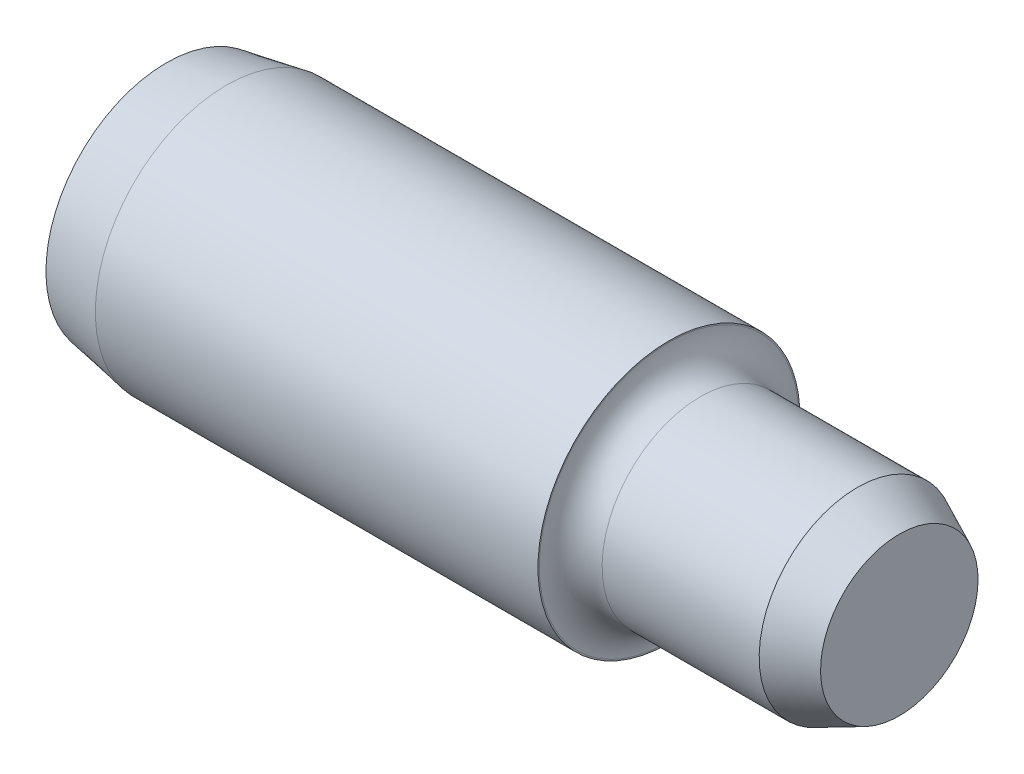
ISO-10303-21;
HEADER;
FILE_DESCRIPTION(('STEP AP214'),'2;1');
FILE_NAME('part.step','',(''),(''),'','','');
FILE_SCHEMA(('AUTOMOTIVE_DESIGN { 1 0 10303 214 1 1 1 1 }'));
ENDSEC;
DATA;
#1=APPLICATION_CONTEXT('core data for automotive mechanical design processes');
#2=APPLICATION_PROTOCOL_DEFINITION('international standard','automotive_design',2000,#1);
#3=PRODUCT_CONTEXT('',#1,'mechanical');
#4=PRODUCT('Part','Part','',(#3));
#5=PRODUCT_RELATED_PRODUCT_CATEGORY('part','',(#4));
#6=PRODUCT_DEFINITION_FORMATION('','',#4);
#7=PRODUCT_DEFINITION_CONTEXT('part definition',#1,'design');
#8=PRODUCT_DEFINITION('design','',#6,#7);
#9=PRODUCT_DEFINITION_SHAPE('','',#8);
#10=(LENGTH_UNIT() NAMED_UNIT(*) SI_UNIT(.MILLI.,.METRE.));
#11=(NAMED_UNIT(*) PLANE_ANGLE_UNIT() SI_UNIT($,.RADIAN.));
#12=(NAMED_UNIT(*) SI_UNIT($,.STERADIAN.) SOLID_ANGLE_UNIT());
#13=UNCERTAINTY_MEASURE_WITH_UNIT(LENGTH_MEASURE(1.E-05),#10,'distance_accuracy_value','');
#14=(GEOMETRIC_REPRESENTATION_CONTEXT(3) GLOBAL_UNCERTAINTY_ASSIGNED_CONTEXT((#13)) GLOBAL_UNIT_ASSIGNED_CONTEXT((#10,
#11,#12)) REPRESENTATION_CONTEXT('',''));
#15=CARTESIAN_POINT('',(0.,0.,0.));
#16=DIRECTION('',(0.,0.,1.));
#17=DIRECTION('',(1.,0.,0.));
#18=AXIS2_PLACEMENT_3D('',#15,#16,#17);
#19=CARTESIAN_POINT('',(0.,0.,0.));
#20=DIRECTION('',(1.,0.,0.));
#21=DIRECTION('',(0.,1.,0.));
#22=AXIS2_PLACEMENT_3D('',#19,#20,#21);
#23=PLANE('',#22);
#24=CARTESIAN_POINT('',(0.,0.,0.));
#25=DIRECTION('',(1.,0.,0.));
#26=DIRECTION('',(0.,1.,0.));
#27=AXIS2_PLACEMENT_3D('',#24,#25,#26);
#28=CIRCLE('',#27,2.921);
#29=CARTESIAN_POINT('',(0.,2.921,0.));
#30=VERTEX_POINT('',#29);
#31=EDGE_CURVE('E84',#30,#30,#28,.T.);
#32=ORIENTED_EDGE('',*,*,#31,.F.);
#33=EDGE_LOOP('',(#32));
#34=FACE_BOUND('',#33,.T.);
#35=ADVANCED_FACE('F53',(#34),#23,.F.);
#36=CARTESIAN_POINT('',(17.78,0.,0.));
#37=DIRECTION('',(-1.,0.,0.));
#38=DIRECTION('',(0.,-1.,0.));
#39=AXIS2_PLACEMENT_3D('',#36,#37,#38);
#40=PLANE('',#39);
#41=CARTESIAN_POINT('',(17.78,0.,0.));
#42=DIRECTION('',(1.,0.,0.));
#43=DIRECTION('',(0.,1.,0.));
#44=AXIS2_PLACEMENT_3D('',#41,#42,#43);
#45=CIRCLE('',#44,1.91002141931453);
#46=CARTESIAN_POINT('',(17.78,1.91002141931453,0.));
#47=VERTEX_POINT('',#46);
#48=EDGE_CURVE('E12',#47,#47,#45,.T.);
#49=ORIENTED_EDGE('',*,*,#48,.T.);
#50=EDGE_LOOP('',(#49));
#51=FACE_BOUND('',#50,.T.);
#52=ADVANCED_FACE('F92',(#51),#40,.F.);
#53=CARTESIAN_POINT('',(16.764,0.,0.));
#54=DIRECTION('',(-1.,0.,0.));
#55=DIRECTION('',(0.,-1.,0.));
#56=AXIS2_PLACEMENT_3D('',#53,#54,#55);
#57=CONICAL_SURFACE('',#56,2.38379,0.436332312998577);
#58=ORIENTED_EDGE('',*,*,#48,.F.);
#59=EDGE_LOOP('',(#58));
#60=FACE_BOUND('',#59,.T.);
#61=CARTESIAN_POINT('',(16.764,0.,0.));
#62=DIRECTION('',(1.,0.,0.));
#63=DIRECTION('',(0.,1.,0.));
#64=AXIS2_PLACEMENT_3D('',#61,#62,#63);
#65=CIRCLE('',#64,2.38379);
#66=CARTESIAN_POINT('',(16.764,2.38379,0.));
#67=VERTEX_POINT('',#66);
#68=EDGE_CURVE('E60',#67,#67,#65,.T.);
#69=ORIENTED_EDGE('',*,*,#68,.T.);
#70=EDGE_LOOP('',(#69));
#71=FACE_BOUND('',#70,.T.);
#72=ADVANCED_FACE('F96',(#60,#71),#57,.T.);
#73=CARTESIAN_POINT('',(0.,0.,0.));
#74=DIRECTION('',(1.,0.,0.));
#75=DIRECTION('',(0.,1.,0.));
#76=AXIS2_PLACEMENT_3D('',#73,#74,#75);
#77=CYLINDRICAL_SURFACE('',#76,2.38379);
#78=ORIENTED_EDGE('',*,*,#68,.F.);
#79=EDGE_LOOP('',(#78));
#80=FACE_BOUND('',#79,.T.);
#81=CARTESIAN_POINT('',(12.954,0.,0.));
#82=DIRECTION('',(1.,0.,0.));
#83=DIRECTION('',(0.,1.,0.));
#84=AXIS2_PLACEMENT_3D('',#81,#82,#83);
#85=CIRCLE('',#84,2.38379);
#86=CARTESIAN_POINT('',(12.954,2.38379,0.));
#87=VERTEX_POINT('',#86);
#88=EDGE_CURVE('E66',#87,#87,#85,.T.);
#89=ORIENTED_EDGE('',*,*,#88,.T.);
#90=EDGE_LOOP('',(#89));
#91=FACE_BOUND('',#90,.T.);
#92=ADVANCED_FACE('F100',(#80,#91),#77,.T.);
#93=CARTESIAN_POINT('',(12.954,0.,0.));
#94=DIRECTION('',(1.,0.,0.));
#95=DIRECTION('',(0.,1.,0.));
#96=AXIS2_PLACEMENT_3D('',#93,#94,#95);
#97=TOROIDAL_SURFACE('',#96,3.14579,0.762);
#98=ORIENTED_EDGE('',*,*,#88,.F.);
#99=EDGE_LOOP('',(#98));
#100=FACE_BOUND('',#99,.T.);
#101=CARTESIAN_POINT('',(12.192,0.,0.));
#102=DIRECTION('',(1.,0.,0.));
#103=DIRECTION('',(0.,1.,0.));
#104=AXIS2_PLACEMENT_3D('',#101,#102,#103);
#105=CIRCLE('',#104,3.14579);
#106=CARTESIAN_POINT('',(12.192,3.14579,0.));
#107=VERTEX_POINT('',#106);
#108=EDGE_CURVE('E71',#107,#107,#105,.T.);
#109=ORIENTED_EDGE('',*,*,#108,.T.);
#110=EDGE_LOOP('',(#109));
#111=FACE_BOUND('',#110,.T.);
#112=ADVANCED_FACE('F106',(#100,#111),#97,.F.);
#113=CARTESIAN_POINT('',(12.192,-3.17754,0.));
#114=DIRECTION('',(-1.,0.,0.));
#115=DIRECTION('',(0.,-1.,0.));
#116=AXIS2_PLACEMENT_3D('',#113,#114,#115);
#117=PLANE('',#116);
#118=ORIENTED_EDGE('',*,*,#108,.F.);
#119=EDGE_LOOP('',(#118));
#120=FACE_BOUND('',#119,.T.);
#121=CARTESIAN_POINT('',(12.192,0.,0.));
#122=DIRECTION('',(1.,0.,0.));
#123=DIRECTION('',(0.,1.,0.));
#124=AXIS2_PLACEMENT_3D('',#121,#122,#123);
#125=CIRCLE('',#124,3.17754);
#126=CARTESIAN_POINT('',(12.192,3.17754,0.));
#127=VERTEX_POINT('',#126);
#128=EDGE_CURVE('E76',#127,#127,#125,.T.);
#129=ORIENTED_EDGE('',*,*,#128,.T.);
#130=EDGE_LOOP('',(#129));
#131=FACE_BOUND('',#130,.T.);
#132=ADVANCED_FACE('F110',(#120,#131),#117,.F.);
#133=CARTESIAN_POINT('',(0.,0.,0.));
#134=DIRECTION('',(1.,0.,0.));
#135=DIRECTION('',(0.,1.,0.));
#136=AXIS2_PLACEMENT_3D('',#133,#134,#135);
#137=CYLINDRICAL_SURFACE('',#136,3.17754);
#138=ORIENTED_EDGE('',*,*,#128,.F.);
#139=EDGE_LOOP('',(#138));
#140=FACE_BOUND('',#139,.T.);
#141=CARTESIAN_POINT('',(1.45491063800472,0.,0.));
#142=DIRECTION('',(1.,0.,0.));
#143=DIRECTION('',(0.,1.,0.));
#144=AXIS2_PLACEMENT_3D('',#141,#142,#143);
#145=CIRCLE('',#144,3.17754);
#146=CARTESIAN_POINT('',(1.45491063800472,3.17754,0.));
#147=VERTEX_POINT('',#146);
#148=EDGE_CURVE('E80',#147,#147,#145,.T.);
#149=ORIENTED_EDGE('',*,*,#148,.T.);
#150=EDGE_LOOP('',(#149));
#151=FACE_BOUND('',#150,.T.);
#152=ADVANCED_FACE('F114',(#140,#151),#137,.T.);
#153=CARTESIAN_POINT('',(0.,0.,0.));
#154=DIRECTION('',(1.,0.,0.));
#155=DIRECTION('',(0.,1.,0.));
#156=AXIS2_PLACEMENT_3D('',#153,#154,#155);
#157=CONICAL_SURFACE('',#156,2.921,0.174532925199433);
#158=ORIENTED_EDGE('',*,*,#148,.F.);
#159=EDGE_LOOP('',(#158));
#160=FACE_BOUND('',#159,.T.);
#161=ORIENTED_EDGE('',*,*,#31,.T.);
#162=EDGE_LOOP('',(#161));
#163=FACE_BOUND('',#162,.T.);
#164=ADVANCED_FACE('F89',(#160,#163),#157,.T.);
#165=CLOSED_SHELL('',(#35,#52,#72,#92,#112,#132,#152,#164));
#166=MANIFOLD_SOLID_BREP('B2',#165);
#167=ADVANCED_BREP_SHAPE_REPRESENTATION('',(#18,#166),#14);
#168=SHAPE_DEFINITION_REPRESENTATION(#9,#167);
ENDSEC;
END-ISO-10303-21;
